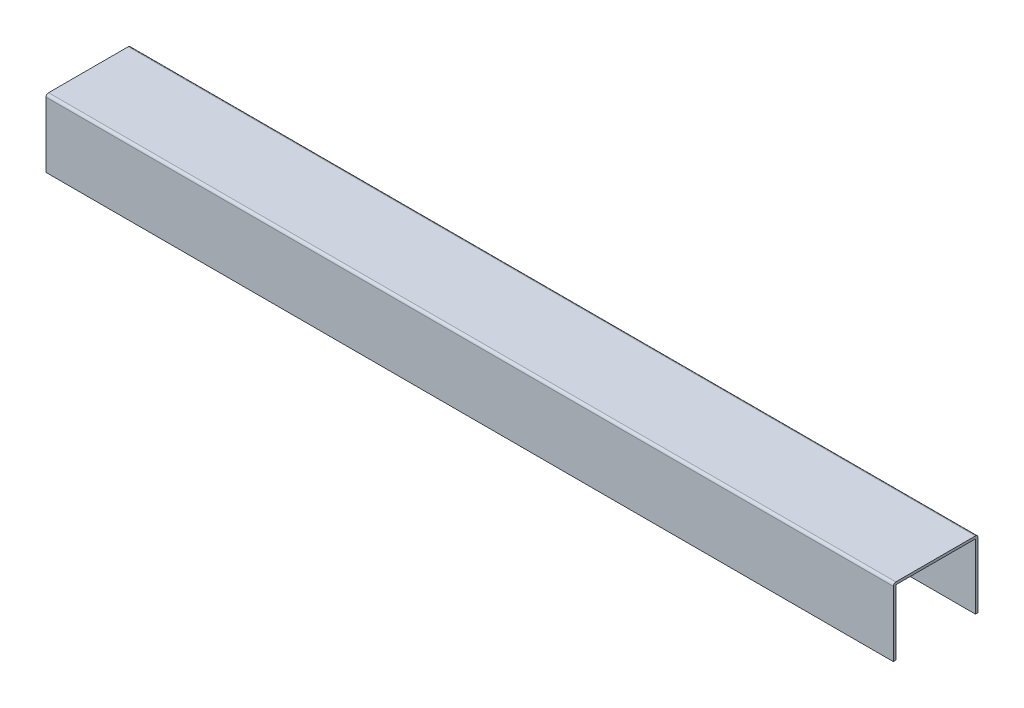
ISO-10303-21;
HEADER;
FILE_DESCRIPTION(('STEP AP214'),'2;1');
FILE_NAME('part.step','',(''),(''),'','','');
FILE_SCHEMA(('AUTOMOTIVE_DESIGN { 1 0 10303 214 1 1 1 1 }'));
ENDSEC;
DATA;
#1=APPLICATION_CONTEXT('core data for automotive mechanical design processes');
#2=APPLICATION_PROTOCOL_DEFINITION('international standard','automotive_design',2000,#1);
#3=PRODUCT_CONTEXT('',#1,'mechanical');
#4=PRODUCT('Part','Part','',(#3));
#5=PRODUCT_RELATED_PRODUCT_CATEGORY('part','',(#4));
#6=PRODUCT_DEFINITION_FORMATION('','',#4);
#7=PRODUCT_DEFINITION_CONTEXT('part definition',#1,'design');
#8=PRODUCT_DEFINITION('design','',#6,#7);
#9=PRODUCT_DEFINITION_SHAPE('','',#8);
#10=(LENGTH_UNIT() NAMED_UNIT(*) SI_UNIT(.MILLI.,.METRE.));
#11=(NAMED_UNIT(*) PLANE_ANGLE_UNIT() SI_UNIT($,.RADIAN.));
#12=(NAMED_UNIT(*) SI_UNIT($,.STERADIAN.) SOLID_ANGLE_UNIT());
#13=UNCERTAINTY_MEASURE_WITH_UNIT(LENGTH_MEASURE(1.E-05),#10,'distance_accuracy_value','');
#14=(GEOMETRIC_REPRESENTATION_CONTEXT(3) GLOBAL_UNCERTAINTY_ASSIGNED_CONTEXT((#13)) GLOBAL_UNIT_ASSIGNED_CONTEXT((#10,
#11,#12)) REPRESENTATION_CONTEXT('',''));
#15=CARTESIAN_POINT('',(0.,0.,0.));
#16=DIRECTION('',(0.,0.,1.));
#17=DIRECTION('',(1.,0.,0.));
#18=AXIS2_PLACEMENT_3D('',#15,#16,#17);
#19=CARTESIAN_POINT('',(1000.,3.,-3.));
#20=DIRECTION('',(1.,0.,0.));
#21=DIRECTION('',(0.,0.,-1.));
#22=AXIS2_PLACEMENT_3D('',#19,#20,#21);
#23=PLANE('',#22);
#24=DIRECTION('',(0.,0.,-1.));
#25=VECTOR('',#24,1.);
#26=CARTESIAN_POINT('',(1000.,20.,0.));
#27=LINE('',#26,#25);
#28=CARTESIAN_POINT('',(1000.,20.,-97.));
#29=VERTEX_POINT('',#28);
#30=CARTESIAN_POINT('',(1000.,20.,-100.));
#31=VERTEX_POINT('',#30);
#32=EDGE_CURVE('E91',#29,#31,#27,.T.);
#33=ORIENTED_EDGE('',*,*,#32,.T.);
#34=DIRECTION('',(0.,1.,0.));
#35=VECTOR('',#34,1.);
#36=CARTESIAN_POINT('',(1000.,3.,-100.));
#37=LINE('',#36,#35);
#38=CARTESIAN_POINT('',(1000.,97.,-100.));
#39=VERTEX_POINT('',#38);
#40=EDGE_CURVE('E179',#31,#39,#37,.T.);
#41=ORIENTED_EDGE('',*,*,#40,.T.);
#42=CARTESIAN_POINT('',(1000.,97.,-97.));
#43=DIRECTION('',(1.,0.,0.));
#44=DIRECTION('',(0.,0.,1.));
#45=AXIS2_PLACEMENT_3D('',#42,#43,#44);
#46=CIRCLE('',#45,3.);
#47=CARTESIAN_POINT('',(1000.,100.,-97.));
#48=VERTEX_POINT('',#47);
#49=EDGE_CURVE('E184',#39,#48,#46,.T.);
#50=ORIENTED_EDGE('',*,*,#49,.T.);
#51=DIRECTION('',(0.,0.,1.));
#52=VECTOR('',#51,1.);
#53=CARTESIAN_POINT('',(1000.,100.,-3.));
#54=LINE('',#53,#52);
#55=CARTESIAN_POINT('',(1000.,100.,-3.));
#56=VERTEX_POINT('',#55);
#57=EDGE_CURVE('E226',#48,#56,#54,.T.);
#58=ORIENTED_EDGE('',*,*,#57,.T.);
#59=CARTESIAN_POINT('',(1000.,97.,-3.));
#60=DIRECTION('',(1.,0.,0.));
#61=DIRECTION('',(0.,0.,1.));
#62=AXIS2_PLACEMENT_3D('',#59,#60,#61);
#63=CIRCLE('',#62,3.);
#64=CARTESIAN_POINT('',(1000.,97.,0.));
#65=VERTEX_POINT('',#64);
#66=EDGE_CURVE('E223',#56,#65,#63,.T.);
#67=ORIENTED_EDGE('',*,*,#66,.T.);
#68=DIRECTION('',(0.,-1.,0.));
#69=VECTOR('',#68,1.);
#70=CARTESIAN_POINT('',(1000.,3.00000000000002,0.));
#71=LINE('',#70,#69);
#72=CARTESIAN_POINT('',(1000.,20.,0.));
#73=VERTEX_POINT('',#72);
#74=EDGE_CURVE('E193',#65,#73,#71,.T.);
#75=ORIENTED_EDGE('',*,*,#74,.T.);
#76=CARTESIAN_POINT('',(1000.,20.,-3.));
#77=VERTEX_POINT('',#76);
#78=EDGE_CURVE('E153',#73,#77,#27,.T.);
#79=ORIENTED_EDGE('',*,*,#78,.T.);
#80=DIRECTION('',(0.,-1.,0.));
#81=VECTOR('',#80,1.);
#82=CARTESIAN_POINT('',(1000.,3.00000000000002,-3.));
#83=LINE('',#82,#81);
#84=CARTESIAN_POINT('',(1000.,97.,-3.));
#85=VERTEX_POINT('',#84);
#86=EDGE_CURVE('E237',#85,#77,#83,.T.);
#87=ORIENTED_EDGE('',*,*,#86,.F.);
#88=DIRECTION('',(0.,0.,1.));
#89=VECTOR('',#88,1.);
#90=CARTESIAN_POINT('',(1000.,97.,-3.));
#91=LINE('',#90,#89);
#92=CARTESIAN_POINT('',(1000.,97.,-97.));
#93=VERTEX_POINT('',#92);
#94=EDGE_CURVE('E251',#93,#85,#91,.T.);
#95=ORIENTED_EDGE('',*,*,#94,.F.);
#96=DIRECTION('',(0.,1.,0.));
#97=VECTOR('',#96,1.);
#98=CARTESIAN_POINT('',(1000.,3.,-97.));
#99=LINE('',#98,#97);
#100=EDGE_CURVE('E240',#29,#93,#99,.T.);
#101=ORIENTED_EDGE('',*,*,#100,.F.);
#102=EDGE_LOOP('',(#33,#41,#50,#58,#67,#75,#79,#87,#95,#101));
#103=FACE_BOUND('',#102,.T.);
#104=ADVANCED_FACE('F75',(#103),#23,.T.);
#105=CARTESIAN_POINT('',(0.,3.,-3.));
#106=DIRECTION('',(1.,0.,0.));
#107=DIRECTION('',(0.,0.,-1.));
#108=AXIS2_PLACEMENT_3D('',#105,#106,#107);
#109=PLANE('',#108);
#110=DIRECTION('',(0.,1.,0.));
#111=VECTOR('',#110,1.);
#112=CARTESIAN_POINT('',(0.,3.,-100.));
#113=LINE('',#112,#111);
#114=CARTESIAN_POINT('',(0.,20.,-100.));
#115=VERTEX_POINT('',#114);
#116=CARTESIAN_POINT('',(0.,97.,-100.));
#117=VERTEX_POINT('',#116);
#118=EDGE_CURVE('E213',#115,#117,#113,.T.);
#119=ORIENTED_EDGE('',*,*,#118,.F.);
#120=DIRECTION('',(0.,0.,-1.));
#121=VECTOR('',#120,1.);
#122=CARTESIAN_POINT('',(0.,20.,0.));
#123=LINE('',#122,#121);
#124=CARTESIAN_POINT('',(0.,20.,-97.));
#125=VERTEX_POINT('',#124);
#126=EDGE_CURVE('E159',#125,#115,#123,.T.);
#127=ORIENTED_EDGE('',*,*,#126,.F.);
#128=DIRECTION('',(0.,1.,0.));
#129=VECTOR('',#128,1.);
#130=CARTESIAN_POINT('',(0.,3.,-97.));
#131=LINE('',#130,#129);
#132=CARTESIAN_POINT('',(0.,97.,-97.));
#133=VERTEX_POINT('',#132);
#134=EDGE_CURVE('E244',#125,#133,#131,.T.);
#135=ORIENTED_EDGE('',*,*,#134,.T.);
#136=DIRECTION('',(0.,0.,1.));
#137=VECTOR('',#136,1.);
#138=CARTESIAN_POINT('',(0.,97.,-3.));
#139=LINE('',#138,#137);
#140=CARTESIAN_POINT('',(0.,97.,-3.));
#141=VERTEX_POINT('',#140);
#142=EDGE_CURVE('E241',#133,#141,#139,.T.);
#143=ORIENTED_EDGE('',*,*,#142,.T.);
#144=DIRECTION('',(0.,-1.,0.));
#145=VECTOR('',#144,1.);
#146=CARTESIAN_POINT('',(0.,3.00000000000002,-3.));
#147=LINE('',#146,#145);
#148=CARTESIAN_POINT('',(0.,20.,-3.));
#149=VERTEX_POINT('',#148);
#150=EDGE_CURVE('E171',#141,#149,#147,.T.);
#151=ORIENTED_EDGE('',*,*,#150,.T.);
#152=CARTESIAN_POINT('',(0.,20.,0.));
#153=VERTEX_POINT('',#152);
#154=EDGE_CURVE('E98',#153,#149,#123,.T.);
#155=ORIENTED_EDGE('',*,*,#154,.F.);
#156=DIRECTION('',(0.,-1.,0.));
#157=VECTOR('',#156,1.);
#158=CARTESIAN_POINT('',(0.,3.00000000000002,0.));
#159=LINE('',#158,#157);
#160=CARTESIAN_POINT('',(0.,97.,0.));
#161=VERTEX_POINT('',#160);
#162=EDGE_CURVE('E168',#161,#153,#159,.T.);
#163=ORIENTED_EDGE('',*,*,#162,.F.);
#164=CARTESIAN_POINT('',(0.,97.,-3.));
#165=DIRECTION('',(1.,0.,0.));
#166=DIRECTION('',(0.,0.,1.));
#167=AXIS2_PLACEMENT_3D('',#164,#165,#166);
#168=CIRCLE('',#167,3.);
#169=CARTESIAN_POINT('',(0.,100.,-3.));
#170=VERTEX_POINT('',#169);
#171=EDGE_CURVE('E180',#170,#161,#168,.T.);
#172=ORIENTED_EDGE('',*,*,#171,.F.);
#173=DIRECTION('',(0.,0.,1.));
#174=VECTOR('',#173,1.);
#175=CARTESIAN_POINT('',(0.,100.,-3.));
#176=LINE('',#175,#174);
#177=CARTESIAN_POINT('',(0.,100.,-97.));
#178=VERTEX_POINT('',#177);
#179=EDGE_CURVE('E186',#178,#170,#176,.T.);
#180=ORIENTED_EDGE('',*,*,#179,.F.);
#181=CARTESIAN_POINT('',(0.,97.,-97.));
#182=DIRECTION('',(1.,0.,0.));
#183=DIRECTION('',(0.,0.,1.));
#184=AXIS2_PLACEMENT_3D('',#181,#182,#183);
#185=CIRCLE('',#184,3.);
#186=EDGE_CURVE('E208',#117,#178,#185,.T.);
#187=ORIENTED_EDGE('',*,*,#186,.F.);
#188=EDGE_LOOP('',(#119,#127,#135,#143,#151,#155,#163,#172,#180,#187));
#189=FACE_BOUND('',#188,.T.);
#190=ADVANCED_FACE('F166',(#189),#109,.F.);
#191=CARTESIAN_POINT('',(1000.,3.,-100.));
#192=DIRECTION('',(0.,0.,1.));
#193=DIRECTION('',(1.,0.,0.));
#194=AXIS2_PLACEMENT_3D('',#191,#192,#193);
#195=PLANE('',#194);
#196=ORIENTED_EDGE('',*,*,#40,.F.);
#197=DIRECTION('',(1.,0.,0.));
#198=VECTOR('',#197,1.);
#199=CARTESIAN_POINT('',(1000.,20.,-100.));
#200=LINE('',#199,#198);
#201=EDGE_CURVE('E160',#115,#31,#200,.T.);
#202=ORIENTED_EDGE('',*,*,#201,.F.);
#203=ORIENTED_EDGE('',*,*,#118,.T.);
#204=DIRECTION('',(-1.,0.,0.));
#205=VECTOR('',#204,1.);
#206=CARTESIAN_POINT('',(1000.,97.,-100.));
#207=LINE('',#206,#205);
#208=EDGE_CURVE('E84',#39,#117,#207,.T.);
#209=ORIENTED_EDGE('',*,*,#208,.F.);
#210=EDGE_LOOP('',(#196,#202,#203,#209));
#211=FACE_BOUND('',#210,.T.);
#212=ADVANCED_FACE('F77',(#211),#195,.F.);
#213=CARTESIAN_POINT('',(1000.,97.,-97.));
#214=DIRECTION('',(-1.,0.,0.));
#215=DIRECTION('',(0.,0.,1.));
#216=AXIS2_PLACEMENT_3D('',#213,#214,#215);
#217=CYLINDRICAL_SURFACE('',#216,3.);
#218=ORIENTED_EDGE('',*,*,#186,.T.);
#219=DIRECTION('',(-1.,0.,0.));
#220=VECTOR('',#219,1.);
#221=CARTESIAN_POINT('',(1000.,100.,-97.));
#222=LINE('',#221,#220);
#223=EDGE_CURVE('E197',#48,#178,#222,.T.);
#224=ORIENTED_EDGE('',*,*,#223,.F.);
#225=ORIENTED_EDGE('',*,*,#49,.F.);
#226=ORIENTED_EDGE('',*,*,#208,.T.);
#227=EDGE_LOOP('',(#218,#224,#225,#226));
#228=FACE_BOUND('',#227,.T.);
#229=ADVANCED_FACE('F206',(#228),#217,.T.);
#230=CARTESIAN_POINT('',(1000.,100.,-3.));
#231=DIRECTION('',(0.,-1.,0.));
#232=DIRECTION('',(0.,0.,-1.));
#233=AXIS2_PLACEMENT_3D('',#230,#231,#232);
#234=PLANE('',#233);
#235=ORIENTED_EDGE('',*,*,#179,.T.);
#236=DIRECTION('',(-1.,0.,0.));
#237=VECTOR('',#236,1.);
#238=CARTESIAN_POINT('',(1000.,100.,-3.));
#239=LINE('',#238,#237);
#240=EDGE_CURVE('E192',#56,#170,#239,.T.);
#241=ORIENTED_EDGE('',*,*,#240,.F.);
#242=ORIENTED_EDGE('',*,*,#57,.F.);
#243=ORIENTED_EDGE('',*,*,#223,.T.);
#244=EDGE_LOOP('',(#235,#241,#242,#243));
#245=FACE_BOUND('',#244,.T.);
#246=ADVANCED_FACE('F273',(#245),#234,.F.);
#247=CARTESIAN_POINT('',(1000.,97.,-3.));
#248=DIRECTION('',(-1.,0.,0.));
#249=DIRECTION('',(0.,0.,1.));
#250=AXIS2_PLACEMENT_3D('',#247,#248,#249);
#251=CYLINDRICAL_SURFACE('',#250,3.);
#252=ORIENTED_EDGE('',*,*,#171,.T.);
#253=DIRECTION('',(-1.,0.,0.));
#254=VECTOR('',#253,1.);
#255=CARTESIAN_POINT('',(1000.,97.,0.));
#256=LINE('',#255,#254);
#257=EDGE_CURVE('E177',#65,#161,#256,.T.);
#258=ORIENTED_EDGE('',*,*,#257,.F.);
#259=ORIENTED_EDGE('',*,*,#66,.F.);
#260=ORIENTED_EDGE('',*,*,#240,.T.);
#261=EDGE_LOOP('',(#252,#258,#259,#260));
#262=FACE_BOUND('',#261,.T.);
#263=ADVANCED_FACE('F285',(#262),#251,.T.);
#264=CARTESIAN_POINT('',(1000.,3.00000000000002,0.));
#265=DIRECTION('',(0.,0.,-1.));
#266=DIRECTION('',(-1.,0.,0.));
#267=AXIS2_PLACEMENT_3D('',#264,#265,#266);
#268=PLANE('',#267);
#269=ORIENTED_EDGE('',*,*,#162,.T.);
#270=DIRECTION('',(1.,0.,0.));
#271=VECTOR('',#270,1.);
#272=CARTESIAN_POINT('',(1000.,20.,0.));
#273=LINE('',#272,#271);
#274=EDGE_CURVE('E150',#153,#73,#273,.T.);
#275=ORIENTED_EDGE('',*,*,#274,.T.);
#276=ORIENTED_EDGE('',*,*,#74,.F.);
#277=ORIENTED_EDGE('',*,*,#257,.T.);
#278=EDGE_LOOP('',(#269,#275,#276,#277));
#279=FACE_BOUND('',#278,.T.);
#280=ADVANCED_FACE('F175',(#279),#268,.F.);
#281=CARTESIAN_POINT('',(1000.,3.,-97.));
#282=DIRECTION('',(0.,0.,1.));
#283=DIRECTION('',(1.,0.,0.));
#284=AXIS2_PLACEMENT_3D('',#281,#282,#283);
#285=PLANE('',#284);
#286=DIRECTION('',(-1.,0.,0.));
#287=VECTOR('',#286,1.);
#288=CARTESIAN_POINT('',(1000.,20.,-97.));
#289=LINE('',#288,#287);
#290=EDGE_CURVE('E247',#29,#125,#289,.T.);
#291=ORIENTED_EDGE('',*,*,#290,.F.);
#292=ORIENTED_EDGE('',*,*,#100,.T.);
#293=DIRECTION('',(-1.,0.,0.));
#294=VECTOR('',#293,1.);
#295=CARTESIAN_POINT('',(1000.,97.,-97.));
#296=LINE('',#295,#294);
#297=EDGE_CURVE('E218',#93,#133,#296,.T.);
#298=ORIENTED_EDGE('',*,*,#297,.T.);
#299=ORIENTED_EDGE('',*,*,#134,.F.);
#300=EDGE_LOOP('',(#291,#292,#298,#299));
#301=FACE_BOUND('',#300,.T.);
#302=ADVANCED_FACE('F280',(#301),#285,.T.);
#303=CARTESIAN_POINT('',(1000.,97.,-3.));
#304=DIRECTION('',(0.,-1.,0.));
#305=DIRECTION('',(0.,0.,-1.));
#306=AXIS2_PLACEMENT_3D('',#303,#304,#305);
#307=PLANE('',#306);
#308=ORIENTED_EDGE('',*,*,#142,.F.);
#309=ORIENTED_EDGE('',*,*,#297,.F.);
#310=ORIENTED_EDGE('',*,*,#94,.T.);
#311=DIRECTION('',(-1.,0.,0.));
#312=VECTOR('',#311,1.);
#313=CARTESIAN_POINT('',(1000.,97.,-3.));
#314=LINE('',#313,#312);
#315=EDGE_CURVE('E234',#85,#141,#314,.T.);
#316=ORIENTED_EDGE('',*,*,#315,.T.);
#317=EDGE_LOOP('',(#308,#309,#310,#316));
#318=FACE_BOUND('',#317,.T.);
#319=ADVANCED_FACE('F302',(#318),#307,.T.);
#320=CARTESIAN_POINT('',(1000.,3.00000000000002,-3.));
#321=DIRECTION('',(0.,0.,-1.));
#322=DIRECTION('',(-1.,0.,0.));
#323=AXIS2_PLACEMENT_3D('',#320,#321,#322);
#324=PLANE('',#323);
#325=DIRECTION('',(1.,0.,0.));
#326=VECTOR('',#325,1.);
#327=CARTESIAN_POINT('',(1000.,20.,-3.));
#328=LINE('',#327,#326);
#329=EDGE_CURVE('E12',#149,#77,#328,.T.);
#330=ORIENTED_EDGE('',*,*,#329,.F.);
#331=ORIENTED_EDGE('',*,*,#150,.F.);
#332=ORIENTED_EDGE('',*,*,#315,.F.);
#333=ORIENTED_EDGE('',*,*,#86,.T.);
#334=EDGE_LOOP('',(#330,#331,#332,#333));
#335=FACE_BOUND('',#334,.T.);
#336=ADVANCED_FACE('F298',(#335),#324,.T.);
#337=CARTESIAN_POINT('',(1000.,20.,0.));
#338=DIRECTION('',(0.,1.,0.));
#339=DIRECTION('',(0.,0.,1.));
#340=AXIS2_PLACEMENT_3D('',#337,#338,#339);
#341=PLANE('',#340);
#342=ORIENTED_EDGE('',*,*,#329,.T.);
#343=ORIENTED_EDGE('',*,*,#78,.F.);
#344=ORIENTED_EDGE('',*,*,#274,.F.);
#345=ORIENTED_EDGE('',*,*,#154,.T.);
#346=EDGE_LOOP('',(#342,#343,#344,#345));
#347=FACE_BOUND('',#346,.T.);
#348=ADVANCED_FACE('F151',(#347),#341,.F.);
#349=ORIENTED_EDGE('',*,*,#290,.T.);
#350=ORIENTED_EDGE('',*,*,#126,.T.);
#351=ORIENTED_EDGE('',*,*,#201,.T.);
#352=ORIENTED_EDGE('',*,*,#32,.F.);
#353=EDGE_LOOP('',(#349,#350,#351,#352));
#354=FACE_BOUND('',#353,.T.);
#355=ADVANCED_FACE('F263',(#354),#341,.F.);
#356=CLOSED_SHELL('',(#104,#190,#212,#229,#246,#263,#280,#302,#319,#336,#348,#355));
#357=MANIFOLD_SOLID_BREP('B2',#356);
#358=ADVANCED_BREP_SHAPE_REPRESENTATION('',(#18,#357),#14);
#359=SHAPE_DEFINITION_REPRESENTATION(#9,#358);
ENDSEC;
END-ISO-10303-21;
